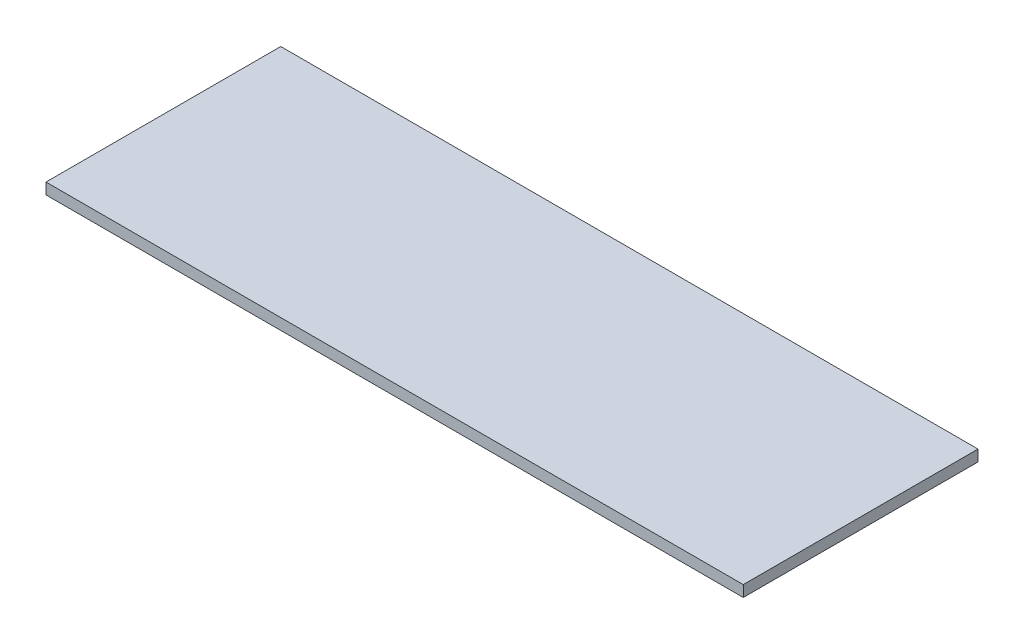
ISO-10303-21;
HEADER;
FILE_DESCRIPTION(('STEP AP214'),'2;1');
FILE_NAME('part.step','',(''),(''),'','','');
FILE_SCHEMA(('AUTOMOTIVE_DESIGN { 1 0 10303 214 1 1 1 1 }'));
ENDSEC;
DATA;
#1=APPLICATION_CONTEXT('core data for automotive mechanical design processes');
#2=APPLICATION_PROTOCOL_DEFINITION('international standard','automotive_design',2000,#1);
#3=PRODUCT_CONTEXT('',#1,'mechanical');
#4=PRODUCT('Part','Part','',(#3));
#5=PRODUCT_RELATED_PRODUCT_CATEGORY('part','',(#4));
#6=PRODUCT_DEFINITION_FORMATION('','',#4);
#7=PRODUCT_DEFINITION_CONTEXT('part definition',#1,'design');
#8=PRODUCT_DEFINITION('design','',#6,#7);
#9=PRODUCT_DEFINITION_SHAPE('','',#8);
#10=(LENGTH_UNIT() NAMED_UNIT(*) SI_UNIT(.MILLI.,.METRE.));
#11=(NAMED_UNIT(*) PLANE_ANGLE_UNIT() SI_UNIT($,.RADIAN.));
#12=(NAMED_UNIT(*) SI_UNIT($,.STERADIAN.) SOLID_ANGLE_UNIT());
#13=UNCERTAINTY_MEASURE_WITH_UNIT(LENGTH_MEASURE(1.E-05),#10,'distance_accuracy_value','');
#14=(GEOMETRIC_REPRESENTATION_CONTEXT(3) GLOBAL_UNCERTAINTY_ASSIGNED_CONTEXT((#13)) GLOBAL_UNIT_ASSIGNED_CONTEXT((#10,
#11,#12)) REPRESENTATION_CONTEXT('',''));
#15=CARTESIAN_POINT('',(0.,0.,0.));
#16=DIRECTION('',(0.,0.,1.));
#17=DIRECTION('',(1.,0.,0.));
#18=AXIS2_PLACEMENT_3D('',#15,#16,#17);
#19=CARTESIAN_POINT('',(0.,19.05,0.));
#20=DIRECTION('',(1.,0.,0.));
#21=DIRECTION('',(0.,0.,-1.));
#22=AXIS2_PLACEMENT_3D('',#19,#20,#21);
#23=PLANE('',#22);
#24=DIRECTION('',(0.,0.,1.));
#25=VECTOR('',#24,1.);
#26=CARTESIAN_POINT('',(0.,0.,0.));
#27=LINE('',#26,#25);
#28=CARTESIAN_POINT('',(0.,0.,-400.));
#29=VERTEX_POINT('',#28);
#30=CARTESIAN_POINT('',(0.,0.,0.));
#31=VERTEX_POINT('',#30);
#32=EDGE_CURVE('E101',#29,#31,#27,.T.);
#33=ORIENTED_EDGE('',*,*,#32,.T.);
#34=DIRECTION('',(0.,-1.,0.));
#35=VECTOR('',#34,1.);
#36=CARTESIAN_POINT('',(0.,19.05,0.));
#37=LINE('',#36,#35);
#38=CARTESIAN_POINT('',(0.,19.05,0.));
#39=VERTEX_POINT('',#38);
#40=EDGE_CURVE('E11',#39,#31,#37,.T.);
#41=ORIENTED_EDGE('',*,*,#40,.F.);
#42=DIRECTION('',(0.,0.,1.));
#43=VECTOR('',#42,1.);
#44=CARTESIAN_POINT('',(0.,19.05,0.));
#45=LINE('',#44,#43);
#46=CARTESIAN_POINT('',(0.,19.05,-400.));
#47=VERTEX_POINT('',#46);
#48=EDGE_CURVE('E89',#47,#39,#45,.T.);
#49=ORIENTED_EDGE('',*,*,#48,.F.);
#50=DIRECTION('',(0.,-1.,0.));
#51=VECTOR('',#50,1.);
#52=CARTESIAN_POINT('',(0.,19.05,-400.));
#53=LINE('',#52,#51);
#54=EDGE_CURVE('E97',#47,#29,#53,.T.);
#55=ORIENTED_EDGE('',*,*,#54,.T.);
#56=EDGE_LOOP('',(#33,#41,#49,#55));
#57=FACE_BOUND('',#56,.T.);
#58=ADVANCED_FACE('F38',(#57),#23,.F.);
#59=CARTESIAN_POINT('',(0.,19.05,0.));
#60=DIRECTION('',(0.,0.,-1.));
#61=DIRECTION('',(-1.,0.,0.));
#62=AXIS2_PLACEMENT_3D('',#59,#60,#61);
#63=PLANE('',#62);
#64=DIRECTION('',(1.,0.,0.));
#65=VECTOR('',#64,1.);
#66=CARTESIAN_POINT('',(0.,0.,0.));
#67=LINE('',#66,#65);
#68=CARTESIAN_POINT('',(1188.1,0.,0.));
#69=VERTEX_POINT('',#68);
#70=EDGE_CURVE('E93',#31,#69,#67,.T.);
#71=ORIENTED_EDGE('',*,*,#70,.T.);
#72=DIRECTION('',(0.,-1.,0.));
#73=VECTOR('',#72,1.);
#74=CARTESIAN_POINT('',(1188.1,19.05,0.));
#75=LINE('',#74,#73);
#76=CARTESIAN_POINT('',(1188.1,19.05,0.));
#77=VERTEX_POINT('',#76);
#78=EDGE_CURVE('E46',#77,#69,#75,.T.);
#79=ORIENTED_EDGE('',*,*,#78,.F.);
#80=DIRECTION('',(1.,0.,0.));
#81=VECTOR('',#80,1.);
#82=CARTESIAN_POINT('',(0.,19.05,0.));
#83=LINE('',#82,#81);
#84=EDGE_CURVE('E84',#39,#77,#83,.T.);
#85=ORIENTED_EDGE('',*,*,#84,.F.);
#86=ORIENTED_EDGE('',*,*,#40,.T.);
#87=EDGE_LOOP('',(#71,#79,#85,#86));
#88=FACE_BOUND('',#87,.T.);
#89=ADVANCED_FACE('F92',(#88),#63,.F.);
#90=CARTESIAN_POINT('',(1188.1,19.05,0.));
#91=DIRECTION('',(-1.,0.,0.));
#92=DIRECTION('',(0.,0.,1.));
#93=AXIS2_PLACEMENT_3D('',#90,#91,#92);
#94=PLANE('',#93);
#95=DIRECTION('',(0.,0.,-1.));
#96=VECTOR('',#95,1.);
#97=CARTESIAN_POINT('',(1188.1,0.,0.));
#98=LINE('',#97,#96);
#99=CARTESIAN_POINT('',(1188.1,0.,-400.));
#100=VERTEX_POINT('',#99);
#101=EDGE_CURVE('E71',#69,#100,#98,.T.);
#102=ORIENTED_EDGE('',*,*,#101,.T.);
#103=DIRECTION('',(0.,-1.,0.));
#104=VECTOR('',#103,1.);
#105=CARTESIAN_POINT('',(1188.1,19.05,-400.));
#106=LINE('',#105,#104);
#107=CARTESIAN_POINT('',(1188.1,19.05,-400.));
#108=VERTEX_POINT('',#107);
#109=EDGE_CURVE('E94',#108,#100,#106,.T.);
#110=ORIENTED_EDGE('',*,*,#109,.F.);
#111=DIRECTION('',(0.,0.,-1.));
#112=VECTOR('',#111,1.);
#113=CARTESIAN_POINT('',(1188.1,19.05,0.));
#114=LINE('',#113,#112);
#115=EDGE_CURVE('E87',#77,#108,#114,.T.);
#116=ORIENTED_EDGE('',*,*,#115,.F.);
#117=ORIENTED_EDGE('',*,*,#78,.T.);
#118=EDGE_LOOP('',(#102,#110,#116,#117));
#119=FACE_BOUND('',#118,.T.);
#120=ADVANCED_FACE('F95',(#119),#94,.F.);
#121=CARTESIAN_POINT('',(0.,19.05,-400.));
#122=DIRECTION('',(0.,0.,1.));
#123=DIRECTION('',(1.,0.,0.));
#124=AXIS2_PLACEMENT_3D('',#121,#122,#123);
#125=PLANE('',#124);
#126=DIRECTION('',(-1.,0.,0.));
#127=VECTOR('',#126,1.);
#128=CARTESIAN_POINT('',(0.,0.,-400.));
#129=LINE('',#128,#127);
#130=EDGE_CURVE('E77',#100,#29,#129,.T.);
#131=ORIENTED_EDGE('',*,*,#130,.T.);
#132=ORIENTED_EDGE('',*,*,#54,.F.);
#133=DIRECTION('',(-1.,0.,0.));
#134=VECTOR('',#133,1.);
#135=CARTESIAN_POINT('',(0.,19.05,-400.));
#136=LINE('',#135,#134);
#137=EDGE_CURVE('E54',#108,#47,#136,.T.);
#138=ORIENTED_EDGE('',*,*,#137,.F.);
#139=ORIENTED_EDGE('',*,*,#109,.T.);
#140=EDGE_LOOP('',(#131,#132,#138,#139));
#141=FACE_BOUND('',#140,.T.);
#142=ADVANCED_FACE('F108',(#141),#125,.F.);
#143=CARTESIAN_POINT('',(0.,19.05,0.));
#144=DIRECTION('',(0.,-1.,0.));
#145=DIRECTION('',(0.,0.,-1.));
#146=AXIS2_PLACEMENT_3D('',#143,#144,#145);
#147=PLANE('',#146);
#148=ORIENTED_EDGE('',*,*,#48,.T.);
#149=ORIENTED_EDGE('',*,*,#84,.T.);
#150=ORIENTED_EDGE('',*,*,#115,.T.);
#151=ORIENTED_EDGE('',*,*,#137,.T.);
#152=EDGE_LOOP('',(#148,#149,#150,#151));
#153=FACE_BOUND('',#152,.T.);
#154=ADVANCED_FACE('F85',(#153),#147,.F.);
#155=CARTESIAN_POINT('',(0.,0.,0.));
#156=DIRECTION('',(0.,-1.,0.));
#157=DIRECTION('',(0.,0.,-1.));
#158=AXIS2_PLACEMENT_3D('',#155,#156,#157);
#159=PLANE('',#158);
#160=ORIENTED_EDGE('',*,*,#32,.F.);
#161=ORIENTED_EDGE('',*,*,#130,.F.);
#162=ORIENTED_EDGE('',*,*,#101,.F.);
#163=ORIENTED_EDGE('',*,*,#70,.F.);
#164=EDGE_LOOP('',(#160,#161,#162,#163));
#165=FACE_BOUND('',#164,.T.);
#166=ADVANCED_FACE('F111',(#165),#159,.T.);
#167=CLOSED_SHELL('',(#58,#89,#120,#142,#154,#166));
#168=MANIFOLD_SOLID_BREP('B2',#167);
#169=ADVANCED_BREP_SHAPE_REPRESENTATION('',(#18,#168),#14);
#170=SHAPE_DEFINITION_REPRESENTATION(#9,#169);
ENDSEC;
END-ISO-10303-21;
